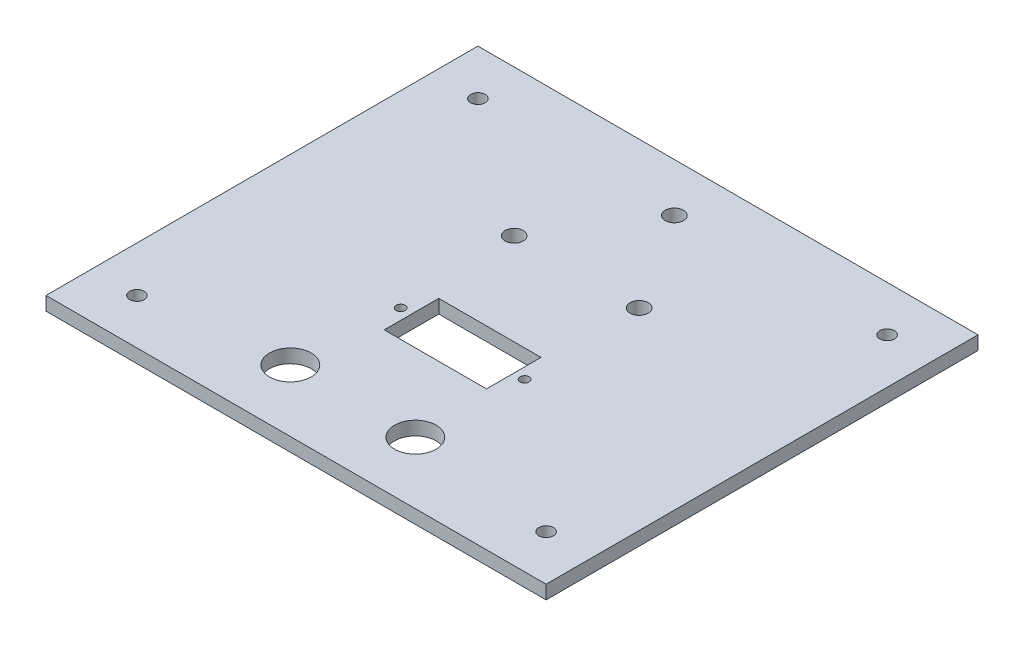
ISO-10303-21;
HEADER;
FILE_DESCRIPTION(('STEP AP214'),'2;1');
FILE_NAME('part.step','',(''),(''),'','','');
FILE_SCHEMA(('AUTOMOTIVE_DESIGN { 1 0 10303 214 1 1 1 1 }'));
ENDSEC;
DATA;
#1=APPLICATION_CONTEXT('core data for automotive mechanical design processes');
#2=APPLICATION_PROTOCOL_DEFINITION('international standard','automotive_design',2000,#1);
#3=PRODUCT_CONTEXT('',#1,'mechanical');
#4=PRODUCT('Part','Part','',(#3));
#5=PRODUCT_RELATED_PRODUCT_CATEGORY('part','',(#4));
#6=PRODUCT_DEFINITION_FORMATION('','',#4);
#7=PRODUCT_DEFINITION_CONTEXT('part definition',#1,'design');
#8=PRODUCT_DEFINITION('design','',#6,#7);
#9=PRODUCT_DEFINITION_SHAPE('','',#8);
#10=(LENGTH_UNIT() NAMED_UNIT(*) SI_UNIT(.MILLI.,.METRE.));
#11=(NAMED_UNIT(*) PLANE_ANGLE_UNIT() SI_UNIT($,.RADIAN.));
#12=(NAMED_UNIT(*) SI_UNIT($,.STERADIAN.) SOLID_ANGLE_UNIT());
#13=UNCERTAINTY_MEASURE_WITH_UNIT(LENGTH_MEASURE(1.E-05),#10,'distance_accuracy_value','');
#14=(GEOMETRIC_REPRESENTATION_CONTEXT(3) GLOBAL_UNCERTAINTY_ASSIGNED_CONTEXT((#13)) GLOBAL_UNIT_ASSIGNED_CONTEXT((#10,
#11,#12)) REPRESENTATION_CONTEXT('',''));
#15=CARTESIAN_POINT('',(0.,0.,0.));
#16=DIRECTION('',(0.,0.,1.));
#17=DIRECTION('',(1.,0.,0.));
#18=AXIS2_PLACEMENT_3D('',#15,#16,#17);
#19=CARTESIAN_POINT('',(0.,3.,47.5));
#20=DIRECTION('',(0.,0.,-1.));
#21=DIRECTION('',(-1.,0.,0.));
#22=AXIS2_PLACEMENT_3D('',#19,#20,#21);
#23=PLANE('',#22);
#24=DIRECTION('',(1.,0.,0.));
#25=VECTOR('',#24,1.);
#26=CARTESIAN_POINT('',(0.,0.,47.5));
#27=LINE('',#26,#25);
#28=CARTESIAN_POINT('',(-55.,0.,47.5));
#29=VERTEX_POINT('',#28);
#30=CARTESIAN_POINT('',(55.,0.,47.5));
#31=VERTEX_POINT('',#30);
#32=EDGE_CURVE('E194',#29,#31,#27,.T.);
#33=ORIENTED_EDGE('',*,*,#32,.T.);
#34=DIRECTION('',(0.,-1.,0.));
#35=VECTOR('',#34,1.);
#36=CARTESIAN_POINT('',(55.,3.,47.5));
#37=LINE('',#36,#35);
#38=CARTESIAN_POINT('',(55.,3.,47.5));
#39=VERTEX_POINT('',#38);
#40=EDGE_CURVE('E260',#39,#31,#37,.T.);
#41=ORIENTED_EDGE('',*,*,#40,.F.);
#42=DIRECTION('',(1.,0.,0.));
#43=VECTOR('',#42,1.);
#44=CARTESIAN_POINT('',(0.,3.,47.5));
#45=LINE('',#44,#43);
#46=CARTESIAN_POINT('',(-55.,3.,47.5));
#47=VERTEX_POINT('',#46);
#48=EDGE_CURVE('E198',#47,#39,#45,.T.);
#49=ORIENTED_EDGE('',*,*,#48,.F.);
#50=DIRECTION('',(0.,-1.,0.));
#51=VECTOR('',#50,1.);
#52=CARTESIAN_POINT('',(-55.,3.,47.5));
#53=LINE('',#52,#51);
#54=EDGE_CURVE('E225',#47,#29,#53,.T.);
#55=ORIENTED_EDGE('',*,*,#54,.T.);
#56=EDGE_LOOP('',(#33,#41,#49,#55));
#57=FACE_BOUND('',#56,.T.);
#58=ADVANCED_FACE('F43',(#57),#23,.F.);
#59=CARTESIAN_POINT('',(55.,3.,0.));
#60=DIRECTION('',(1.,0.,0.));
#61=DIRECTION('',(0.,0.,-1.));
#62=AXIS2_PLACEMENT_3D('',#59,#60,#61);
#63=PLANE('',#62);
#64=DIRECTION('',(0.,0.,1.));
#65=VECTOR('',#64,1.);
#66=CARTESIAN_POINT('',(55.,0.,0.));
#67=LINE('',#66,#65);
#68=CARTESIAN_POINT('',(55.,0.,-47.5));
#69=VERTEX_POINT('',#68);
#70=EDGE_CURVE('E229',#69,#31,#67,.T.);
#71=ORIENTED_EDGE('',*,*,#70,.F.);
#72=DIRECTION('',(0.,-1.,0.));
#73=VECTOR('',#72,1.);
#74=CARTESIAN_POINT('',(55.,3.,-47.5));
#75=LINE('',#74,#73);
#76=CARTESIAN_POINT('',(55.,3.,-47.5));
#77=VERTEX_POINT('',#76);
#78=EDGE_CURVE('E257',#77,#69,#75,.T.);
#79=ORIENTED_EDGE('',*,*,#78,.F.);
#80=DIRECTION('',(0.,0.,1.));
#81=VECTOR('',#80,1.);
#82=CARTESIAN_POINT('',(55.,3.,0.));
#83=LINE('',#82,#81);
#84=EDGE_CURVE('E201',#77,#39,#83,.T.);
#85=ORIENTED_EDGE('',*,*,#84,.T.);
#86=ORIENTED_EDGE('',*,*,#40,.T.);
#87=EDGE_LOOP('',(#71,#79,#85,#86));
#88=FACE_BOUND('',#87,.T.);
#89=ADVANCED_FACE('F294',(#88),#63,.T.);
#90=CARTESIAN_POINT('',(0.,3.,-47.5));
#91=DIRECTION('',(0.,0.,-1.));
#92=DIRECTION('',(-1.,0.,0.));
#93=AXIS2_PLACEMENT_3D('',#90,#91,#92);
#94=PLANE('',#93);
#95=DIRECTION('',(1.,0.,0.));
#96=VECTOR('',#95,1.);
#97=CARTESIAN_POINT('',(0.,0.,-47.5));
#98=LINE('',#97,#96);
#99=CARTESIAN_POINT('',(-55.,0.,-47.5));
#100=VERTEX_POINT('',#99);
#101=EDGE_CURVE('E233',#100,#69,#98,.T.);
#102=ORIENTED_EDGE('',*,*,#101,.F.);
#103=DIRECTION('',(0.,-1.,0.));
#104=VECTOR('',#103,1.);
#105=CARTESIAN_POINT('',(-55.,3.,-47.5));
#106=LINE('',#105,#104);
#107=CARTESIAN_POINT('',(-55.,3.,-47.5));
#108=VERTEX_POINT('',#107);
#109=EDGE_CURVE('E254',#108,#100,#106,.T.);
#110=ORIENTED_EDGE('',*,*,#109,.F.);
#111=DIRECTION('',(1.,0.,0.));
#112=VECTOR('',#111,1.);
#113=CARTESIAN_POINT('',(0.,3.,-47.5));
#114=LINE('',#113,#112);
#115=EDGE_CURVE('E206',#108,#77,#114,.T.);
#116=ORIENTED_EDGE('',*,*,#115,.T.);
#117=ORIENTED_EDGE('',*,*,#78,.T.);
#118=EDGE_LOOP('',(#102,#110,#116,#117));
#119=FACE_BOUND('',#118,.T.);
#120=ADVANCED_FACE('F299',(#119),#94,.T.);
#121=CARTESIAN_POINT('',(-14.8849900476672,3.,-15.3556065702672));
#122=DIRECTION('',(0.,-1.,0.));
#123=DIRECTION('',(0.,0.,-1.));
#124=AXIS2_PLACEMENT_3D('',#121,#122,#123);
#125=CYLINDRICAL_SURFACE('',#124,2.);
#126=CARTESIAN_POINT('',(-14.8849900476672,3.,-15.3556065702672));
#127=DIRECTION('',(0.,1.,0.));
#128=DIRECTION('',(0.,0.,1.));
#129=AXIS2_PLACEMENT_3D('',#126,#127,#128);
#130=CIRCLE('',#129,2.);
#131=CARTESIAN_POINT('',(-14.8849900476672,3.,-13.3556065702671));
#132=VERTEX_POINT('',#131);
#133=EDGE_CURVE('E217',#132,#132,#130,.T.);
#134=ORIENTED_EDGE('',*,*,#133,.T.);
#135=EDGE_LOOP('',(#134));
#136=FACE_BOUND('',#135,.T.);
#137=CARTESIAN_POINT('',(-14.8849900476672,0.,-15.3556065702672));
#138=DIRECTION('',(0.,1.,0.));
#139=DIRECTION('',(0.,0.,1.));
#140=AXIS2_PLACEMENT_3D('',#137,#138,#139);
#141=CIRCLE('',#140,2.);
#142=CARTESIAN_POINT('',(-14.8849900476672,0.,-13.3556065702671));
#143=VERTEX_POINT('',#142);
#144=EDGE_CURVE('E244',#143,#143,#141,.T.);
#145=ORIENTED_EDGE('',*,*,#144,.F.);
#146=EDGE_LOOP('',(#145));
#147=FACE_BOUND('',#146,.T.);
#148=ADVANCED_FACE('F328',(#136,#147),#125,.F.);
#149=CARTESIAN_POINT('',(12.6150099523328,3.,-15.3556065702672));
#150=DIRECTION('',(0.,-1.,0.));
#151=DIRECTION('',(0.,0.,-1.));
#152=AXIS2_PLACEMENT_3D('',#149,#150,#151);
#153=CYLINDRICAL_SURFACE('',#152,2.);
#154=CARTESIAN_POINT('',(12.6150099523328,3.,-15.3556065702672));
#155=DIRECTION('',(0.,1.,0.));
#156=DIRECTION('',(0.,0.,1.));
#157=AXIS2_PLACEMENT_3D('',#154,#155,#156);
#158=CIRCLE('',#157,2.);
#159=CARTESIAN_POINT('',(12.6150099523328,3.,-13.3556065702672));
#160=VERTEX_POINT('',#159);
#161=EDGE_CURVE('E213',#160,#160,#158,.T.);
#162=ORIENTED_EDGE('',*,*,#161,.T.);
#163=EDGE_LOOP('',(#162));
#164=FACE_BOUND('',#163,.T.);
#165=CARTESIAN_POINT('',(12.6150099523328,0.,-15.3556065702672));
#166=DIRECTION('',(0.,1.,0.));
#167=DIRECTION('',(0.,0.,1.));
#168=AXIS2_PLACEMENT_3D('',#165,#166,#167);
#169=CIRCLE('',#168,2.);
#170=CARTESIAN_POINT('',(12.6150099523328,0.,-13.3556065702672));
#171=VERTEX_POINT('',#170);
#172=EDGE_CURVE('E240',#171,#171,#169,.T.);
#173=ORIENTED_EDGE('',*,*,#172,.F.);
#174=EDGE_LOOP('',(#173));
#175=FACE_BOUND('',#174,.T.);
#176=ADVANCED_FACE('F320',(#164,#175),#153,.F.);
#177=CARTESIAN_POINT('',(-55.,3.,0.));
#178=DIRECTION('',(1.,0.,0.));
#179=DIRECTION('',(0.,0.,-1.));
#180=AXIS2_PLACEMENT_3D('',#177,#178,#179);
#181=PLANE('',#180);
#182=DIRECTION('',(0.,0.,1.));
#183=VECTOR('',#182,1.);
#184=CARTESIAN_POINT('',(-55.,0.,0.));
#185=LINE('',#184,#183);
#186=EDGE_CURVE('E237',#100,#29,#185,.T.);
#187=ORIENTED_EDGE('',*,*,#186,.T.);
#188=ORIENTED_EDGE('',*,*,#54,.F.);
#189=DIRECTION('',(0.,0.,1.));
#190=VECTOR('',#189,1.);
#191=CARTESIAN_POINT('',(-55.,3.,0.));
#192=LINE('',#191,#190);
#193=EDGE_CURVE('E210',#108,#47,#192,.T.);
#194=ORIENTED_EDGE('',*,*,#193,.F.);
#195=ORIENTED_EDGE('',*,*,#109,.T.);
#196=EDGE_LOOP('',(#187,#188,#194,#195));
#197=FACE_BOUND('',#196,.T.);
#198=ADVANCED_FACE('F317',(#197),#181,.F.);
#199=CARTESIAN_POINT('',(-1.1349900476672,3.,-36.8556065702671));
#200=DIRECTION('',(0.,-1.,0.));
#201=DIRECTION('',(0.,0.,-1.));
#202=AXIS2_PLACEMENT_3D('',#199,#200,#201);
#203=CYLINDRICAL_SURFACE('',#202,2.);
#204=CARTESIAN_POINT('',(-1.1349900476672,3.,-36.8556065702671));
#205=DIRECTION('',(0.,1.,0.));
#206=DIRECTION('',(0.,0.,1.));
#207=AXIS2_PLACEMENT_3D('',#204,#205,#206);
#208=CIRCLE('',#207,2.);
#209=CARTESIAN_POINT('',(-1.1349900476672,3.,-34.8556065702671));
#210=VERTEX_POINT('',#209);
#211=EDGE_CURVE('E221',#210,#210,#208,.T.);
#212=ORIENTED_EDGE('',*,*,#211,.T.);
#213=EDGE_LOOP('',(#212));
#214=FACE_BOUND('',#213,.T.);
#215=CARTESIAN_POINT('',(-1.1349900476672,0.,-36.8556065702671));
#216=DIRECTION('',(0.,1.,0.));
#217=DIRECTION('',(0.,0.,1.));
#218=AXIS2_PLACEMENT_3D('',#215,#216,#217);
#219=CIRCLE('',#218,2.);
#220=CARTESIAN_POINT('',(-1.1349900476672,0.,-34.8556065702671));
#221=VERTEX_POINT('',#220);
#222=EDGE_CURVE('E202',#221,#221,#219,.T.);
#223=ORIENTED_EDGE('',*,*,#222,.F.);
#224=EDGE_LOOP('',(#223));
#225=FACE_BOUND('',#224,.T.);
#226=ADVANCED_FACE('F319',(#214,#225),#203,.F.);
#227=CARTESIAN_POINT('',(0.,3.,0.));
#228=DIRECTION('',(0.,1.,0.));
#229=DIRECTION('',(0.,0.,1.));
#230=AXIS2_PLACEMENT_3D('',#227,#228,#229);
#231=PLANE('',#230);
#232=CARTESIAN_POINT('',(-13.625,3.,10.8587158642607));
#233=DIRECTION('',(0.,1.,0.));
#234=DIRECTION('',(0.,0.,1.));
#235=AXIS2_PLACEMENT_3D('',#232,#233,#234);
#236=CIRCLE('',#235,1.);
#237=CARTESIAN_POINT('',(-13.625,3.,11.8587158642607));
#238=VERTEX_POINT('',#237);
#239=EDGE_CURVE('E140',#238,#238,#236,.T.);
#240=ORIENTED_EDGE('',*,*,#239,.F.);
#241=EDGE_LOOP('',(#240));
#242=FACE_BOUND('',#241,.T.);
#243=DIRECTION('',(1.,0.,0.));
#244=VECTOR('',#243,1.);
#245=CARTESIAN_POINT('',(0.,3.,16.8587158642607));
#246=LINE('',#245,#244);
#247=CARTESIAN_POINT('',(-11.25,3.,16.8587158642607));
#248=VERTEX_POINT('',#247);
#249=CARTESIAN_POINT('',(11.25,3.,16.8587158642607));
#250=VERTEX_POINT('',#249);
#251=EDGE_CURVE('E59',#248,#250,#246,.T.);
#252=ORIENTED_EDGE('',*,*,#251,.F.);
#253=DIRECTION('',(0.,0.,1.));
#254=VECTOR('',#253,1.);
#255=CARTESIAN_POINT('',(-11.25,3.,0.));
#256=LINE('',#255,#254);
#257=CARTESIAN_POINT('',(-11.25,3.,4.85871586426066));
#258=VERTEX_POINT('',#257);
#259=EDGE_CURVE('E130',#258,#248,#256,.T.);
#260=ORIENTED_EDGE('',*,*,#259,.F.);
#261=DIRECTION('',(1.,0.,0.));
#262=VECTOR('',#261,1.);
#263=CARTESIAN_POINT('',(0.,3.,4.85871586426066));
#264=LINE('',#263,#262);
#265=CARTESIAN_POINT('',(11.25,3.,4.85871586426066));
#266=VERTEX_POINT('',#265);
#267=EDGE_CURVE('E112',#258,#266,#264,.T.);
#268=ORIENTED_EDGE('',*,*,#267,.T.);
#269=DIRECTION('',(0.,0.,1.));
#270=VECTOR('',#269,1.);
#271=CARTESIAN_POINT('',(11.25,3.,0.));
#272=LINE('',#271,#270);
#273=EDGE_CURVE('E122',#266,#250,#272,.T.);
#274=ORIENTED_EDGE('',*,*,#273,.T.);
#275=EDGE_LOOP('',(#252,#260,#268,#274));
#276=FACE_BOUND('',#275,.T.);
#277=CARTESIAN_POINT('',(13.625,3.,10.8587158642607));
#278=DIRECTION('',(0.,1.,0.));
#279=DIRECTION('',(0.,0.,1.));
#280=AXIS2_PLACEMENT_3D('',#277,#278,#279);
#281=CIRCLE('',#280,0.999999999999994);
#282=CARTESIAN_POINT('',(13.625,3.,11.8587158642606));
#283=VERTEX_POINT('',#282);
#284=EDGE_CURVE('E145',#283,#283,#281,.T.);
#285=ORIENTED_EDGE('',*,*,#284,.F.);
#286=EDGE_LOOP('',(#285));
#287=FACE_BOUND('',#286,.T.);
#288=CARTESIAN_POINT('',(-14.8849900476672,3.,33.8696909376107));
#289=DIRECTION('',(0.,1.,0.));
#290=DIRECTION('',(0.,0.,1.));
#291=AXIS2_PLACEMENT_3D('',#288,#289,#290);
#292=CIRCLE('',#291,4.575);
#293=CARTESIAN_POINT('',(-14.8849900476672,3.,38.4446909376107));
#294=VERTEX_POINT('',#293);
#295=EDGE_CURVE('E154',#294,#294,#292,.T.);
#296=ORIENTED_EDGE('',*,*,#295,.F.);
#297=EDGE_LOOP('',(#296));
#298=FACE_BOUND('',#297,.T.);
#299=CARTESIAN_POINT('',(12.6150099523328,3.,33.8696909376107));
#300=DIRECTION('',(0.,1.,0.));
#301=DIRECTION('',(0.,0.,1.));
#302=AXIS2_PLACEMENT_3D('',#299,#300,#301);
#303=CIRCLE('',#302,4.57500000000001);
#304=CARTESIAN_POINT('',(12.6150099523328,3.,38.4446909376107));
#305=VERTEX_POINT('',#304);
#306=EDGE_CURVE('E158',#305,#305,#303,.T.);
#307=ORIENTED_EDGE('',*,*,#306,.F.);
#308=EDGE_LOOP('',(#307));
#309=FACE_BOUND('',#308,.T.);
#310=CARTESIAN_POINT('',(45.,3.,-37.5));
#311=DIRECTION('',(0.,1.,0.));
#312=DIRECTION('',(0.,0.,1.));
#313=AXIS2_PLACEMENT_3D('',#310,#311,#312);
#314=CIRCLE('',#313,1.6);
#315=CARTESIAN_POINT('',(45.,3.,-35.9));
#316=VERTEX_POINT('',#315);
#317=EDGE_CURVE('E179',#316,#316,#314,.T.);
#318=ORIENTED_EDGE('',*,*,#317,.F.);
#319=EDGE_LOOP('',(#318));
#320=FACE_BOUND('',#319,.T.);
#321=CARTESIAN_POINT('',(-45.,3.,37.5));
#322=DIRECTION('',(0.,1.,0.));
#323=DIRECTION('',(0.,0.,1.));
#324=AXIS2_PLACEMENT_3D('',#321,#322,#323);
#325=CIRCLE('',#324,1.6);
#326=CARTESIAN_POINT('',(-45.,3.,39.1));
#327=VERTEX_POINT('',#326);
#328=EDGE_CURVE('E170',#327,#327,#325,.T.);
#329=ORIENTED_EDGE('',*,*,#328,.F.);
#330=EDGE_LOOP('',(#329));
#331=FACE_BOUND('',#330,.T.);
#332=CARTESIAN_POINT('',(45.,3.,37.5));
#333=DIRECTION('',(0.,1.,0.));
#334=DIRECTION('',(0.,0.,1.));
#335=AXIS2_PLACEMENT_3D('',#332,#333,#334);
#336=CIRCLE('',#335,1.60000000000001);
#337=CARTESIAN_POINT('',(45.,3.,39.1));
#338=VERTEX_POINT('',#337);
#339=EDGE_CURVE('E153',#338,#338,#336,.T.);
#340=ORIENTED_EDGE('',*,*,#339,.F.);
#341=EDGE_LOOP('',(#340));
#342=FACE_BOUND('',#341,.T.);
#343=CARTESIAN_POINT('',(-45.,3.,-37.5));
#344=DIRECTION('',(0.,1.,0.));
#345=DIRECTION('',(0.,0.,1.));
#346=AXIS2_PLACEMENT_3D('',#343,#344,#345);
#347=CIRCLE('',#346,1.6);
#348=CARTESIAN_POINT('',(-45.,3.,-35.9));
#349=VERTEX_POINT('',#348);
#350=EDGE_CURVE('E178',#349,#349,#347,.T.);
#351=ORIENTED_EDGE('',*,*,#350,.F.);
#352=EDGE_LOOP('',(#351));
#353=FACE_BOUND('',#352,.T.);
#354=ORIENTED_EDGE('',*,*,#48,.T.);
#355=ORIENTED_EDGE('',*,*,#84,.F.);
#356=ORIENTED_EDGE('',*,*,#115,.F.);
#357=ORIENTED_EDGE('',*,*,#193,.T.);
#358=EDGE_LOOP('',(#354,#355,#356,#357));
#359=FACE_BOUND('',#358,.T.);
#360=ORIENTED_EDGE('',*,*,#161,.F.);
#361=EDGE_LOOP('',(#360));
#362=FACE_BOUND('',#361,.T.);
#363=ORIENTED_EDGE('',*,*,#133,.F.);
#364=EDGE_LOOP('',(#363));
#365=FACE_BOUND('',#364,.T.);
#366=ORIENTED_EDGE('',*,*,#211,.F.);
#367=EDGE_LOOP('',(#366));
#368=FACE_BOUND('',#367,.T.);
#369=ADVANCED_FACE('F127',(#242,#276,#287,#298,#309,#320,#331,#342,#353,#359,#362,#365,#368),
#231,.T.);
#370=CARTESIAN_POINT('',(0.,0.,0.));
#371=DIRECTION('',(0.,1.,0.));
#372=DIRECTION('',(0.,0.,1.));
#373=AXIS2_PLACEMENT_3D('',#370,#371,#372);
#374=PLANE('',#373);
#375=CARTESIAN_POINT('',(-13.625,0.,10.8587158642607));
#376=DIRECTION('',(0.,1.,0.));
#377=DIRECTION('',(0.,0.,1.));
#378=AXIS2_PLACEMENT_3D('',#375,#376,#377);
#379=CIRCLE('',#378,1.);
#380=CARTESIAN_POINT('',(-13.625,0.,11.8587158642607));
#381=VERTEX_POINT('',#380);
#382=EDGE_CURVE('E46',#381,#381,#379,.T.);
#383=ORIENTED_EDGE('',*,*,#382,.T.);
#384=EDGE_LOOP('',(#383));
#385=FACE_BOUND('',#384,.T.);
#386=DIRECTION('',(0.,0.,1.));
#387=VECTOR('',#386,1.);
#388=CARTESIAN_POINT('',(-11.25,0.,0.));
#389=LINE('',#388,#387);
#390=CARTESIAN_POINT('',(-11.25,0.,4.85871586426066));
#391=VERTEX_POINT('',#390);
#392=CARTESIAN_POINT('',(-11.25,0.,16.8587158642607));
#393=VERTEX_POINT('',#392);
#394=EDGE_CURVE('E52',#391,#393,#389,.T.);
#395=ORIENTED_EDGE('',*,*,#394,.T.);
#396=DIRECTION('',(1.,0.,0.));
#397=VECTOR('',#396,1.);
#398=CARTESIAN_POINT('',(0.,0.,16.8587158642607));
#399=LINE('',#398,#397);
#400=CARTESIAN_POINT('',(11.25,0.,16.8587158642607));
#401=VERTEX_POINT('',#400);
#402=EDGE_CURVE('E11',#393,#401,#399,.T.);
#403=ORIENTED_EDGE('',*,*,#402,.T.);
#404=DIRECTION('',(0.,0.,1.));
#405=VECTOR('',#404,1.);
#406=CARTESIAN_POINT('',(11.25,0.,0.));
#407=LINE('',#406,#405);
#408=CARTESIAN_POINT('',(11.25,0.,4.85871586426066));
#409=VERTEX_POINT('',#408);
#410=EDGE_CURVE('E263',#409,#401,#407,.T.);
#411=ORIENTED_EDGE('',*,*,#410,.F.);
#412=DIRECTION('',(1.,0.,0.));
#413=VECTOR('',#412,1.);
#414=CARTESIAN_POINT('',(0.,0.,4.85871586426066));
#415=LINE('',#414,#413);
#416=EDGE_CURVE('E115',#391,#409,#415,.T.);
#417=ORIENTED_EDGE('',*,*,#416,.F.);
#418=EDGE_LOOP('',(#395,#403,#411,#417));
#419=FACE_BOUND('',#418,.T.);
#420=CARTESIAN_POINT('',(13.625,0.,10.8587158642607));
#421=DIRECTION('',(0.,1.,0.));
#422=DIRECTION('',(0.,0.,1.));
#423=AXIS2_PLACEMENT_3D('',#420,#421,#422);
#424=CIRCLE('',#423,0.999999999999994);
#425=CARTESIAN_POINT('',(13.625,0.,11.8587158642606));
#426=VERTEX_POINT('',#425);
#427=EDGE_CURVE('E264',#426,#426,#424,.T.);
#428=ORIENTED_EDGE('',*,*,#427,.T.);
#429=EDGE_LOOP('',(#428));
#430=FACE_BOUND('',#429,.T.);
#431=CARTESIAN_POINT('',(-14.8849900476672,0.,33.8696909376107));
#432=DIRECTION('',(0.,1.,0.));
#433=DIRECTION('',(0.,0.,1.));
#434=AXIS2_PLACEMENT_3D('',#431,#432,#433);
#435=CIRCLE('',#434,4.575);
#436=CARTESIAN_POINT('',(-14.8849900476672,0.,38.4446909376107));
#437=VERTEX_POINT('',#436);
#438=EDGE_CURVE('E149',#437,#437,#435,.T.);
#439=ORIENTED_EDGE('',*,*,#438,.T.);
#440=EDGE_LOOP('',(#439));
#441=FACE_BOUND('',#440,.T.);
#442=CARTESIAN_POINT('',(12.6150099523328,0.,33.8696909376107));
#443=DIRECTION('',(0.,1.,0.));
#444=DIRECTION('',(0.,0.,1.));
#445=AXIS2_PLACEMENT_3D('',#442,#443,#444);
#446=CIRCLE('',#445,4.57500000000001);
#447=CARTESIAN_POINT('',(12.6150099523328,0.,38.4446909376107));
#448=VERTEX_POINT('',#447);
#449=EDGE_CURVE('E162',#448,#448,#446,.T.);
#450=ORIENTED_EDGE('',*,*,#449,.T.);
#451=EDGE_LOOP('',(#450));
#452=FACE_BOUND('',#451,.T.);
#453=CARTESIAN_POINT('',(45.,0.,-37.5));
#454=DIRECTION('',(0.,1.,0.));
#455=DIRECTION('',(0.,0.,1.));
#456=AXIS2_PLACEMENT_3D('',#453,#454,#455);
#457=CIRCLE('',#456,1.6);
#458=CARTESIAN_POINT('',(45.,0.,-35.9));
#459=VERTEX_POINT('',#458);
#460=EDGE_CURVE('E174',#459,#459,#457,.T.);
#461=ORIENTED_EDGE('',*,*,#460,.T.);
#462=EDGE_LOOP('',(#461));
#463=FACE_BOUND('',#462,.T.);
#464=CARTESIAN_POINT('',(-45.,0.,37.5));
#465=DIRECTION('',(0.,1.,0.));
#466=DIRECTION('',(0.,0.,1.));
#467=AXIS2_PLACEMENT_3D('',#464,#465,#466);
#468=CIRCLE('',#467,1.6);
#469=CARTESIAN_POINT('',(-45.,0.,39.1));
#470=VERTEX_POINT('',#469);
#471=EDGE_CURVE('E183',#470,#470,#468,.T.);
#472=ORIENTED_EDGE('',*,*,#471,.T.);
#473=EDGE_LOOP('',(#472));
#474=FACE_BOUND('',#473,.T.);
#475=CARTESIAN_POINT('',(45.,0.,37.5));
#476=DIRECTION('',(0.,1.,0.));
#477=DIRECTION('',(0.,0.,1.));
#478=AXIS2_PLACEMENT_3D('',#475,#476,#477);
#479=CIRCLE('',#478,1.60000000000001);
#480=CARTESIAN_POINT('',(45.,0.,39.1));
#481=VERTEX_POINT('',#480);
#482=EDGE_CURVE('E166',#481,#481,#479,.T.);
#483=ORIENTED_EDGE('',*,*,#482,.T.);
#484=EDGE_LOOP('',(#483));
#485=FACE_BOUND('',#484,.T.);
#486=CARTESIAN_POINT('',(-45.,0.,-37.5));
#487=DIRECTION('',(0.,1.,0.));
#488=DIRECTION('',(0.,0.,1.));
#489=AXIS2_PLACEMENT_3D('',#486,#487,#488);
#490=CIRCLE('',#489,1.6);
#491=CARTESIAN_POINT('',(-45.,0.,-35.9));
#492=VERTEX_POINT('',#491);
#493=EDGE_CURVE('E190',#492,#492,#490,.T.);
#494=ORIENTED_EDGE('',*,*,#493,.T.);
#495=EDGE_LOOP('',(#494));
#496=FACE_BOUND('',#495,.T.);
#497=ORIENTED_EDGE('',*,*,#32,.F.);
#498=ORIENTED_EDGE('',*,*,#186,.F.);
#499=ORIENTED_EDGE('',*,*,#101,.T.);
#500=ORIENTED_EDGE('',*,*,#70,.T.);
#501=EDGE_LOOP('',(#497,#498,#499,#500));
#502=FACE_BOUND('',#501,.T.);
#503=ORIENTED_EDGE('',*,*,#172,.T.);
#504=EDGE_LOOP('',(#503));
#505=FACE_BOUND('',#504,.T.);
#506=ORIENTED_EDGE('',*,*,#144,.T.);
#507=EDGE_LOOP('',(#506));
#508=FACE_BOUND('',#507,.T.);
#509=ORIENTED_EDGE('',*,*,#222,.T.);
#510=EDGE_LOOP('',(#509));
#511=FACE_BOUND('',#510,.T.);
#512=ADVANCED_FACE('F275',(#385,#419,#430,#441,#452,#463,#474,#485,#496,#502,#505,#508,#511),
#374,.F.);
#513=CARTESIAN_POINT('',(-45.,0.,-37.5));
#514=DIRECTION('',(0.,1.,0.));
#515=DIRECTION('',(0.,0.,1.));
#516=AXIS2_PLACEMENT_3D('',#513,#514,#515);
#517=CYLINDRICAL_SURFACE('',#516,1.6);
#518=ORIENTED_EDGE('',*,*,#493,.F.);
#519=EDGE_LOOP('',(#518));
#520=FACE_BOUND('',#519,.T.);
#521=ORIENTED_EDGE('',*,*,#350,.T.);
#522=EDGE_LOOP('',(#521));
#523=FACE_BOUND('',#522,.T.);
#524=ADVANCED_FACE('F344',(#520,#523),#517,.F.);
#525=CARTESIAN_POINT('',(45.,0.,37.5));
#526=DIRECTION('',(0.,1.,0.));
#527=DIRECTION('',(0.,0.,1.));
#528=AXIS2_PLACEMENT_3D('',#525,#526,#527);
#529=CYLINDRICAL_SURFACE('',#528,1.60000000000001);
#530=ORIENTED_EDGE('',*,*,#482,.F.);
#531=EDGE_LOOP('',(#530));
#532=FACE_BOUND('',#531,.T.);
#533=ORIENTED_EDGE('',*,*,#339,.T.);
#534=EDGE_LOOP('',(#533));
#535=FACE_BOUND('',#534,.T.);
#536=ADVANCED_FACE('F351',(#532,#535),#529,.F.);
#537=CARTESIAN_POINT('',(-45.,0.,37.5));
#538=DIRECTION('',(0.,1.,0.));
#539=DIRECTION('',(0.,0.,1.));
#540=AXIS2_PLACEMENT_3D('',#537,#538,#539);
#541=CYLINDRICAL_SURFACE('',#540,1.6);
#542=ORIENTED_EDGE('',*,*,#471,.F.);
#543=EDGE_LOOP('',(#542));
#544=FACE_BOUND('',#543,.T.);
#545=ORIENTED_EDGE('',*,*,#328,.T.);
#546=EDGE_LOOP('',(#545));
#547=FACE_BOUND('',#546,.T.);
#548=ADVANCED_FACE('F353',(#544,#547),#541,.F.);
#549=CARTESIAN_POINT('',(45.,0.,-37.5));
#550=DIRECTION('',(0.,1.,0.));
#551=DIRECTION('',(0.,0.,1.));
#552=AXIS2_PLACEMENT_3D('',#549,#550,#551);
#553=CYLINDRICAL_SURFACE('',#552,1.6);
#554=ORIENTED_EDGE('',*,*,#460,.F.);
#555=EDGE_LOOP('',(#554));
#556=FACE_BOUND('',#555,.T.);
#557=ORIENTED_EDGE('',*,*,#317,.T.);
#558=EDGE_LOOP('',(#557));
#559=FACE_BOUND('',#558,.T.);
#560=ADVANCED_FACE('F356',(#556,#559),#553,.F.);
#561=CARTESIAN_POINT('',(12.6150099523328,0.,33.8696909376107));
#562=DIRECTION('',(0.,1.,0.));
#563=DIRECTION('',(0.,0.,1.));
#564=AXIS2_PLACEMENT_3D('',#561,#562,#563);
#565=CYLINDRICAL_SURFACE('',#564,4.57500000000001);
#566=ORIENTED_EDGE('',*,*,#449,.F.);
#567=EDGE_LOOP('',(#566));
#568=FACE_BOUND('',#567,.T.);
#569=ORIENTED_EDGE('',*,*,#306,.T.);
#570=EDGE_LOOP('',(#569));
#571=FACE_BOUND('',#570,.T.);
#572=ADVANCED_FACE('F360',(#568,#571),#565,.F.);
#573=CARTESIAN_POINT('',(-14.8849900476672,0.,33.8696909376107));
#574=DIRECTION('',(0.,1.,0.));
#575=DIRECTION('',(0.,0.,1.));
#576=AXIS2_PLACEMENT_3D('',#573,#574,#575);
#577=CYLINDRICAL_SURFACE('',#576,4.575);
#578=ORIENTED_EDGE('',*,*,#438,.F.);
#579=EDGE_LOOP('',(#578));
#580=FACE_BOUND('',#579,.T.);
#581=ORIENTED_EDGE('',*,*,#295,.T.);
#582=EDGE_LOOP('',(#581));
#583=FACE_BOUND('',#582,.T.);
#584=ADVANCED_FACE('F289',(#580,#583),#577,.F.);
#585=CARTESIAN_POINT('',(13.625,-7.,10.8587158642607));
#586=DIRECTION('',(0.,1.,0.));
#587=DIRECTION('',(0.,0.,1.));
#588=AXIS2_PLACEMENT_3D('',#585,#586,#587);
#589=CYLINDRICAL_SURFACE('',#588,0.999999999999994);
#590=ORIENTED_EDGE('',*,*,#284,.T.);
#591=EDGE_LOOP('',(#590));
#592=FACE_BOUND('',#591,.T.);
#593=ORIENTED_EDGE('',*,*,#427,.F.);
#594=EDGE_LOOP('',(#593));
#595=FACE_BOUND('',#594,.T.);
#596=ADVANCED_FACE('F282',(#592,#595),#589,.F.);
#597=CARTESIAN_POINT('',(0.,-7.,16.8587158642607));
#598=DIRECTION('',(0.,0.,1.));
#599=DIRECTION('',(1.,0.,0.));
#600=AXIS2_PLACEMENT_3D('',#597,#598,#599);
#601=PLANE('',#600);
#602=DIRECTION('',(0.,1.,0.));
#603=VECTOR('',#602,1.);
#604=CARTESIAN_POINT('',(-11.25,-7.,16.8587158642607));
#605=LINE('',#604,#603);
#606=EDGE_CURVE('E137',#393,#248,#605,.T.);
#607=ORIENTED_EDGE('',*,*,#606,.T.);
#608=ORIENTED_EDGE('',*,*,#251,.T.);
#609=DIRECTION('',(0.,1.,0.));
#610=VECTOR('',#609,1.);
#611=CARTESIAN_POINT('',(11.25,-7.,16.8587158642607));
#612=LINE('',#611,#610);
#613=EDGE_CURVE('E119',#401,#250,#612,.T.);
#614=ORIENTED_EDGE('',*,*,#613,.F.);
#615=ORIENTED_EDGE('',*,*,#402,.F.);
#616=EDGE_LOOP('',(#607,#608,#614,#615));
#617=FACE_BOUND('',#616,.T.);
#618=ADVANCED_FACE('F280',(#617),#601,.F.);
#619=CARTESIAN_POINT('',(-11.25,-7.,0.));
#620=DIRECTION('',(-1.,0.,0.));
#621=DIRECTION('',(0.,0.,1.));
#622=AXIS2_PLACEMENT_3D('',#619,#620,#621);
#623=PLANE('',#622);
#624=DIRECTION('',(0.,1.,0.));
#625=VECTOR('',#624,1.);
#626=CARTESIAN_POINT('',(-11.25,-7.,4.85871586426066));
#627=LINE('',#626,#625);
#628=EDGE_CURVE('E118',#391,#258,#627,.T.);
#629=ORIENTED_EDGE('',*,*,#628,.T.);
#630=ORIENTED_EDGE('',*,*,#259,.T.);
#631=ORIENTED_EDGE('',*,*,#606,.F.);
#632=ORIENTED_EDGE('',*,*,#394,.F.);
#633=EDGE_LOOP('',(#629,#630,#631,#632));
#634=FACE_BOUND('',#633,.T.);
#635=ADVANCED_FACE('F279',(#634),#623,.F.);
#636=CARTESIAN_POINT('',(0.,-7.,4.85871586426066));
#637=DIRECTION('',(0.,0.,1.));
#638=DIRECTION('',(1.,0.,0.));
#639=AXIS2_PLACEMENT_3D('',#636,#637,#638);
#640=PLANE('',#639);
#641=ORIENTED_EDGE('',*,*,#416,.T.);
#642=DIRECTION('',(0.,1.,0.));
#643=VECTOR('',#642,1.);
#644=CARTESIAN_POINT('',(11.25,-7.,4.85871586426066));
#645=LINE('',#644,#643);
#646=EDGE_CURVE('E67',#409,#266,#645,.T.);
#647=ORIENTED_EDGE('',*,*,#646,.T.);
#648=ORIENTED_EDGE('',*,*,#267,.F.);
#649=ORIENTED_EDGE('',*,*,#628,.F.);
#650=EDGE_LOOP('',(#641,#647,#648,#649));
#651=FACE_BOUND('',#650,.T.);
#652=ADVANCED_FACE('F109',(#651),#640,.T.);
#653=CARTESIAN_POINT('',(11.25,-7.,0.));
#654=DIRECTION('',(-1.,0.,0.));
#655=DIRECTION('',(0.,0.,1.));
#656=AXIS2_PLACEMENT_3D('',#653,#654,#655);
#657=PLANE('',#656);
#658=ORIENTED_EDGE('',*,*,#410,.T.);
#659=ORIENTED_EDGE('',*,*,#613,.T.);
#660=ORIENTED_EDGE('',*,*,#273,.F.);
#661=ORIENTED_EDGE('',*,*,#646,.F.);
#662=EDGE_LOOP('',(#658,#659,#660,#661));
#663=FACE_BOUND('',#662,.T.);
#664=ADVANCED_FACE('F123',(#663),#657,.T.);
#665=CARTESIAN_POINT('',(-13.625,-7.,10.8587158642607));
#666=DIRECTION('',(0.,1.,0.));
#667=DIRECTION('',(0.,0.,1.));
#668=AXIS2_PLACEMENT_3D('',#665,#666,#667);
#669=CYLINDRICAL_SURFACE('',#668,1.);
#670=ORIENTED_EDGE('',*,*,#239,.T.);
#671=EDGE_LOOP('',(#670));
#672=FACE_BOUND('',#671,.T.);
#673=ORIENTED_EDGE('',*,*,#382,.F.);
#674=EDGE_LOOP('',(#673));
#675=FACE_BOUND('',#674,.T.);
#676=ADVANCED_FACE('F439',(#672,#675),#669,.F.);
#677=CLOSED_SHELL('',(#58,#89,#120,#148,#176,#198,#226,#369,#512,#524,#536,#548,#560,#572,#584,
#596,#618,#635,#652,#664,#676));
#678=MANIFOLD_SOLID_BREP('B2',#677);
#679=ADVANCED_BREP_SHAPE_REPRESENTATION('',(#18,#678),#14);
#680=SHAPE_DEFINITION_REPRESENTATION(#9,#679);
ENDSEC;
END-ISO-10303-21;
